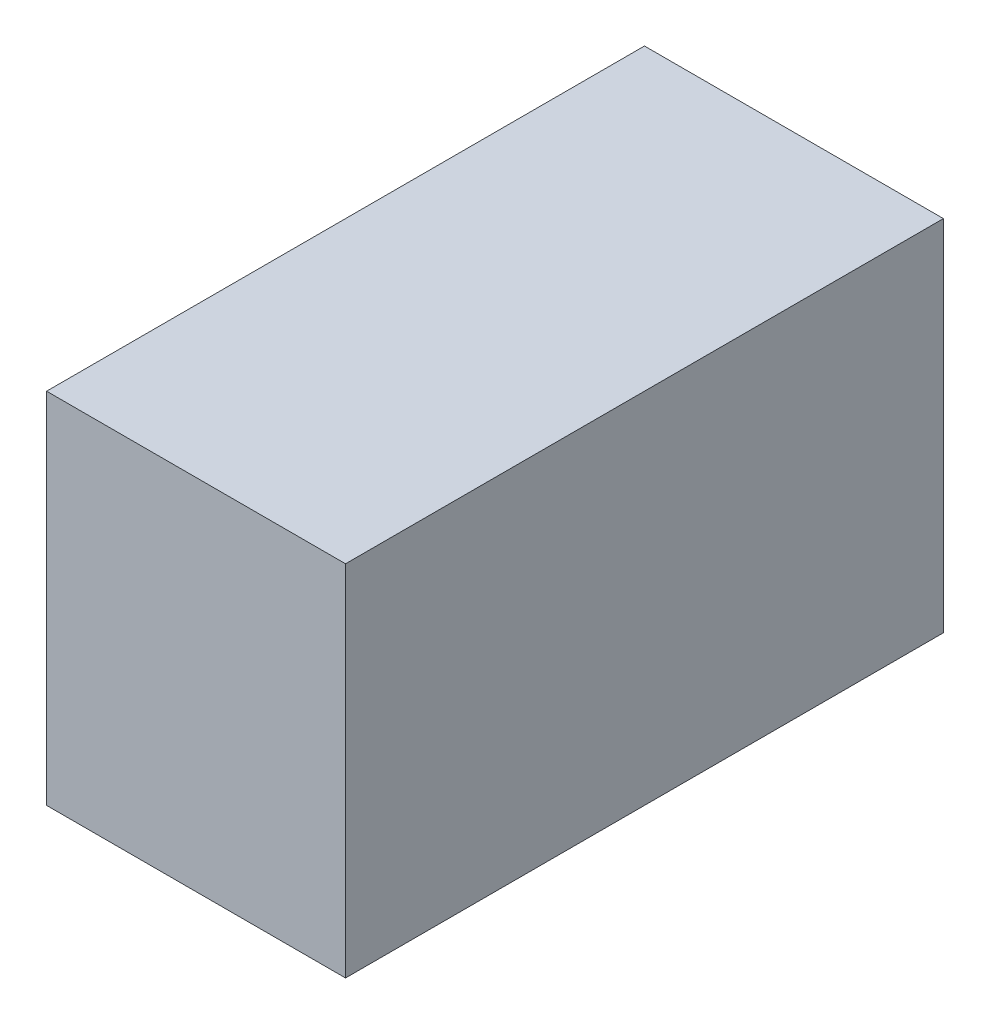
ISO-10303-21;
HEADER;
FILE_DESCRIPTION(('STEP AP214'),'2;1');
FILE_NAME('part.step','',(''),(''),'','','');
FILE_SCHEMA(('AUTOMOTIVE_DESIGN { 1 0 10303 214 1 1 1 1 }'));
ENDSEC;
DATA;
#1=APPLICATION_CONTEXT('core data for automotive mechanical design processes');
#2=APPLICATION_PROTOCOL_DEFINITION('international standard','automotive_design',2000,#1);
#3=PRODUCT_CONTEXT('',#1,'mechanical');
#4=PRODUCT('Part','Part','',(#3));
#5=PRODUCT_RELATED_PRODUCT_CATEGORY('part','',(#4));
#6=PRODUCT_DEFINITION_FORMATION('','',#4);
#7=PRODUCT_DEFINITION_CONTEXT('part definition',#1,'design');
#8=PRODUCT_DEFINITION('design','',#6,#7);
#9=PRODUCT_DEFINITION_SHAPE('','',#8);
#10=(LENGTH_UNIT() NAMED_UNIT(*) SI_UNIT(.MILLI.,.METRE.));
#11=(NAMED_UNIT(*) PLANE_ANGLE_UNIT() SI_UNIT($,.RADIAN.));
#12=(NAMED_UNIT(*) SI_UNIT($,.STERADIAN.) SOLID_ANGLE_UNIT());
#13=UNCERTAINTY_MEASURE_WITH_UNIT(LENGTH_MEASURE(1.E-05),#10,'distance_accuracy_value','');
#14=(GEOMETRIC_REPRESENTATION_CONTEXT(3) GLOBAL_UNCERTAINTY_ASSIGNED_CONTEXT((#13)) GLOBAL_UNIT_ASSIGNED_CONTEXT((#10,
#11,#12)) REPRESENTATION_CONTEXT('',''));
#15=CARTESIAN_POINT('',(0.,0.,0.));
#16=DIRECTION('',(0.,0.,1.));
#17=DIRECTION('',(1.,0.,0.));
#18=AXIS2_PLACEMENT_3D('',#15,#16,#17);
#19=CARTESIAN_POINT('',(3.175,4.40972222222223,3.70416666666667));
#20=DIRECTION('',(0.,-1.,0.));
#21=DIRECTION('',(0.,0.,-1.));
#22=AXIS2_PLACEMENT_3D('',#19,#20,#21);
#23=PLANE('',#22);
#24=DIRECTION('',(0.,0.,1.));
#25=VECTOR('',#24,1.);
#26=CARTESIAN_POINT('',(0.,4.40972222222223,3.70416666666667));
#27=LINE('',#26,#25);
#28=CARTESIAN_POINT('',(0.,4.40972222222223,3.70416666666667));
#29=VERTEX_POINT('',#28);
#30=CARTESIAN_POINT('',(0.,4.40972222222223,10.0541666666667));
#31=VERTEX_POINT('',#30);
#32=EDGE_CURVE('E96',#29,#31,#27,.T.);
#33=ORIENTED_EDGE('',*,*,#32,.T.);
#34=DIRECTION('',(-1.,0.,0.));
#35=VECTOR('',#34,1.);
#36=CARTESIAN_POINT('',(3.175,4.40972222222223,10.0541666666667));
#37=LINE('',#36,#35);
#38=CARTESIAN_POINT('',(3.175,4.40972222222223,10.0541666666667));
#39=VERTEX_POINT('',#38);
#40=EDGE_CURVE('E11',#39,#31,#37,.T.);
#41=ORIENTED_EDGE('',*,*,#40,.F.);
#42=DIRECTION('',(0.,0.,1.));
#43=VECTOR('',#42,1.);
#44=CARTESIAN_POINT('',(3.175,4.40972222222223,3.70416666666667));
#45=LINE('',#44,#43);
#46=CARTESIAN_POINT('',(3.175,4.40972222222223,3.70416666666667));
#47=VERTEX_POINT('',#46);
#48=EDGE_CURVE('E84',#47,#39,#45,.T.);
#49=ORIENTED_EDGE('',*,*,#48,.F.);
#50=DIRECTION('',(-1.,0.,0.));
#51=VECTOR('',#50,1.);
#52=CARTESIAN_POINT('',(3.175,4.40972222222223,3.70416666666667));
#53=LINE('',#52,#51);
#54=EDGE_CURVE('E92',#47,#29,#53,.T.);
#55=ORIENTED_EDGE('',*,*,#54,.T.);
#56=EDGE_LOOP('',(#33,#41,#49,#55));
#57=FACE_BOUND('',#56,.T.);
#58=ADVANCED_FACE('F33',(#57),#23,.F.);
#59=CARTESIAN_POINT('',(3.175,4.40972222222223,10.0541666666667));
#60=DIRECTION('',(0.,0.,-1.));
#61=DIRECTION('',(-1.,0.,0.));
#62=AXIS2_PLACEMENT_3D('',#59,#60,#61);
#63=PLANE('',#62);
#64=DIRECTION('',(0.,-1.,0.));
#65=VECTOR('',#64,1.);
#66=CARTESIAN_POINT('',(0.,4.40972222222223,10.0541666666667));
#67=LINE('',#66,#65);
#68=CARTESIAN_POINT('',(0.,0.599722222222228,10.0541666666667));
#69=VERTEX_POINT('',#68);
#70=EDGE_CURVE('E88',#31,#69,#67,.T.);
#71=ORIENTED_EDGE('',*,*,#70,.T.);
#72=DIRECTION('',(-1.,0.,0.));
#73=VECTOR('',#72,1.);
#74=CARTESIAN_POINT('',(3.175,0.599722222222228,10.0541666666667));
#75=LINE('',#74,#73);
#76=CARTESIAN_POINT('',(3.175,0.599722222222228,10.0541666666667));
#77=VERTEX_POINT('',#76);
#78=EDGE_CURVE('E41',#77,#69,#75,.T.);
#79=ORIENTED_EDGE('',*,*,#78,.F.);
#80=DIRECTION('',(0.,-1.,0.));
#81=VECTOR('',#80,1.);
#82=CARTESIAN_POINT('',(3.175,4.40972222222223,10.0541666666667));
#83=LINE('',#82,#81);
#84=EDGE_CURVE('E79',#39,#77,#83,.T.);
#85=ORIENTED_EDGE('',*,*,#84,.F.);
#86=ORIENTED_EDGE('',*,*,#40,.T.);
#87=EDGE_LOOP('',(#71,#79,#85,#86));
#88=FACE_BOUND('',#87,.T.);
#89=ADVANCED_FACE('F87',(#88),#63,.F.);
#90=CARTESIAN_POINT('',(3.175,0.599722222222228,10.0541666666667));
#91=DIRECTION('',(0.,1.,0.));
#92=DIRECTION('',(0.,0.,1.));
#93=AXIS2_PLACEMENT_3D('',#90,#91,#92);
#94=PLANE('',#93);
#95=DIRECTION('',(0.,0.,-1.));
#96=VECTOR('',#95,1.);
#97=CARTESIAN_POINT('',(0.,0.599722222222228,10.0541666666667));
#98=LINE('',#97,#96);
#99=CARTESIAN_POINT('',(0.,0.599722222222228,3.70416666666667));
#100=VERTEX_POINT('',#99);
#101=EDGE_CURVE('E66',#69,#100,#98,.T.);
#102=ORIENTED_EDGE('',*,*,#101,.T.);
#103=DIRECTION('',(-1.,0.,0.));
#104=VECTOR('',#103,1.);
#105=CARTESIAN_POINT('',(3.175,0.599722222222228,3.70416666666667));
#106=LINE('',#105,#104);
#107=CARTESIAN_POINT('',(3.175,0.599722222222228,3.70416666666667));
#108=VERTEX_POINT('',#107);
#109=EDGE_CURVE('E89',#108,#100,#106,.T.);
#110=ORIENTED_EDGE('',*,*,#109,.F.);
#111=DIRECTION('',(0.,0.,-1.));
#112=VECTOR('',#111,1.);
#113=CARTESIAN_POINT('',(3.175,0.599722222222228,10.0541666666667));
#114=LINE('',#113,#112);
#115=EDGE_CURVE('E82',#77,#108,#114,.T.);
#116=ORIENTED_EDGE('',*,*,#115,.F.);
#117=ORIENTED_EDGE('',*,*,#78,.T.);
#118=EDGE_LOOP('',(#102,#110,#116,#117));
#119=FACE_BOUND('',#118,.T.);
#120=ADVANCED_FACE('F90',(#119),#94,.F.);
#121=CARTESIAN_POINT('',(3.175,0.599722222222228,3.70416666666667));
#122=DIRECTION('',(0.,0.,1.));
#123=DIRECTION('',(1.,0.,0.));
#124=AXIS2_PLACEMENT_3D('',#121,#122,#123);
#125=PLANE('',#124);
#126=DIRECTION('',(0.,1.,0.));
#127=VECTOR('',#126,1.);
#128=CARTESIAN_POINT('',(0.,0.599722222222228,3.70416666666667));
#129=LINE('',#128,#127);
#130=EDGE_CURVE('E72',#100,#29,#129,.T.);
#131=ORIENTED_EDGE('',*,*,#130,.T.);
#132=ORIENTED_EDGE('',*,*,#54,.F.);
#133=DIRECTION('',(0.,1.,0.));
#134=VECTOR('',#133,1.);
#135=CARTESIAN_POINT('',(3.175,0.599722222222228,3.70416666666667));
#136=LINE('',#135,#134);
#137=EDGE_CURVE('E49',#108,#47,#136,.T.);
#138=ORIENTED_EDGE('',*,*,#137,.F.);
#139=ORIENTED_EDGE('',*,*,#109,.T.);
#140=EDGE_LOOP('',(#131,#132,#138,#139));
#141=FACE_BOUND('',#140,.T.);
#142=ADVANCED_FACE('F103',(#141),#125,.F.);
#143=CARTESIAN_POINT('',(3.175,0.,0.));
#144=DIRECTION('',(1.,0.,0.));
#145=DIRECTION('',(0.,0.,-1.));
#146=AXIS2_PLACEMENT_3D('',#143,#144,#145);
#147=PLANE('',#146);
#148=ORIENTED_EDGE('',*,*,#48,.T.);
#149=ORIENTED_EDGE('',*,*,#84,.T.);
#150=ORIENTED_EDGE('',*,*,#115,.T.);
#151=ORIENTED_EDGE('',*,*,#137,.T.);
#152=EDGE_LOOP('',(#148,#149,#150,#151));
#153=FACE_BOUND('',#152,.T.);
#154=ADVANCED_FACE('F80',(#153),#147,.T.);
#155=CARTESIAN_POINT('',(0.,0.,0.));
#156=DIRECTION('',(1.,0.,0.));
#157=DIRECTION('',(0.,0.,-1.));
#158=AXIS2_PLACEMENT_3D('',#155,#156,#157);
#159=PLANE('',#158);
#160=ORIENTED_EDGE('',*,*,#32,.F.);
#161=ORIENTED_EDGE('',*,*,#130,.F.);
#162=ORIENTED_EDGE('',*,*,#101,.F.);
#163=ORIENTED_EDGE('',*,*,#70,.F.);
#164=EDGE_LOOP('',(#160,#161,#162,#163));
#165=FACE_BOUND('',#164,.T.);
#166=ADVANCED_FACE('F106',(#165),#159,.F.);
#167=CLOSED_SHELL('',(#58,#89,#120,#142,#154,#166));
#168=MANIFOLD_SOLID_BREP('B2',#167);
#169=ADVANCED_BREP_SHAPE_REPRESENTATION('',(#18,#168),#14);
#170=SHAPE_DEFINITION_REPRESENTATION(#9,#169);
ENDSEC;
END-ISO-10303-21;
